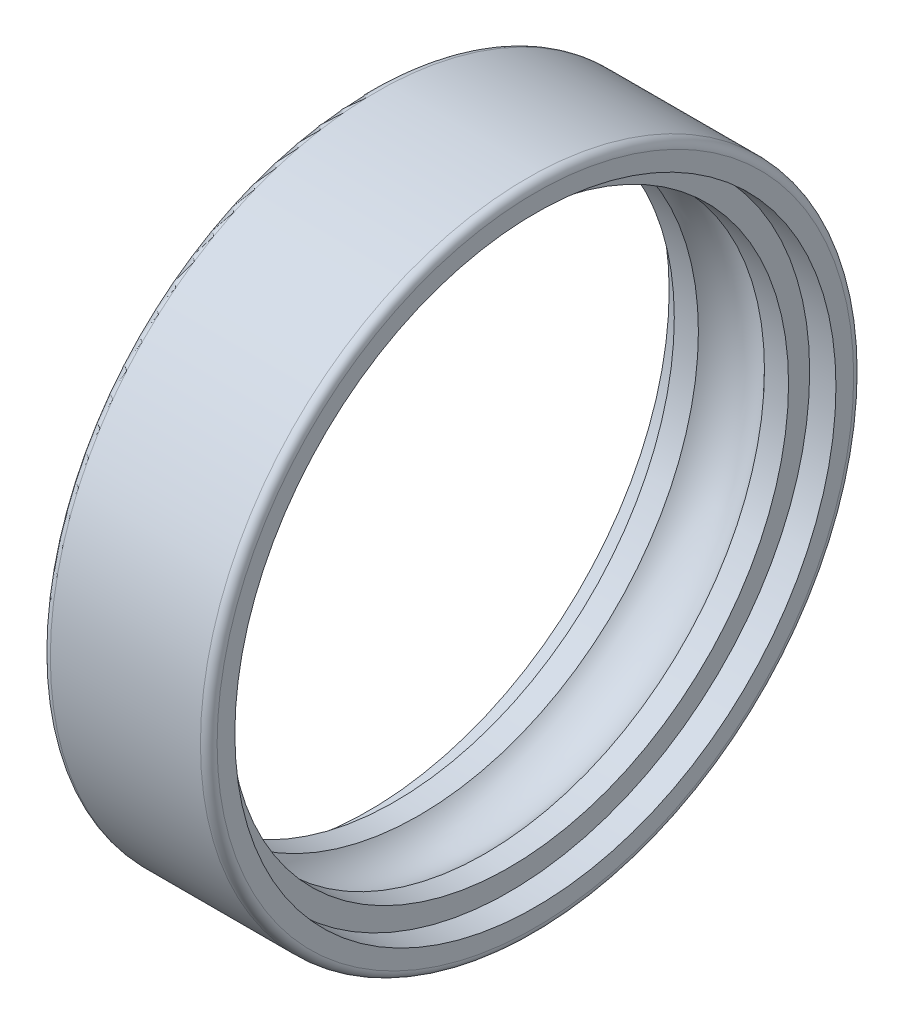
ISO-10303-21;
HEADER;
FILE_DESCRIPTION(('STEP AP214'),'2;1');
FILE_NAME('part.step','',(''),(''),'','','');
FILE_SCHEMA(('AUTOMOTIVE_DESIGN { 1 0 10303 214 1 1 1 1 }'));
ENDSEC;
DATA;
#1=APPLICATION_CONTEXT('core data for automotive mechanical design processes');
#2=APPLICATION_PROTOCOL_DEFINITION('international standard','automotive_design',2000,#1);
#3=PRODUCT_CONTEXT('',#1,'mechanical');
#4=PRODUCT('Part','Part','',(#3));
#5=PRODUCT_RELATED_PRODUCT_CATEGORY('part','',(#4));
#6=PRODUCT_DEFINITION_FORMATION('','',#4);
#7=PRODUCT_DEFINITION_CONTEXT('part definition',#1,'design');
#8=PRODUCT_DEFINITION('design','',#6,#7);
#9=PRODUCT_DEFINITION_SHAPE('','',#8);
#10=(LENGTH_UNIT() NAMED_UNIT(*) SI_UNIT(.MILLI.,.METRE.));
#11=(NAMED_UNIT(*) PLANE_ANGLE_UNIT() SI_UNIT($,.RADIAN.));
#12=(NAMED_UNIT(*) SI_UNIT($,.STERADIAN.) SOLID_ANGLE_UNIT());
#13=UNCERTAINTY_MEASURE_WITH_UNIT(LENGTH_MEASURE(1.E-05),#10,'distance_accuracy_value','');
#14=(GEOMETRIC_REPRESENTATION_CONTEXT(3) GLOBAL_UNCERTAINTY_ASSIGNED_CONTEXT((#13)) GLOBAL_UNIT_ASSIGNED_CONTEXT((#10,
#11,#12)) REPRESENTATION_CONTEXT('',''));
#15=CARTESIAN_POINT('',(0.,0.,0.));
#16=DIRECTION('',(0.,0.,1.));
#17=DIRECTION('',(1.,0.,0.));
#18=AXIS2_PLACEMENT_3D('',#15,#16,#17);
#19=CARTESIAN_POINT('',(6.,0.,0.));
#20=DIRECTION('',(1.,0.,0.));
#21=DIRECTION('',(0.,1.,0.));
#22=AXIS2_PLACEMENT_3D('',#19,#20,#21);
#23=TOROIDAL_SURFACE('',#22,18.,3.175);
#24=CARTESIAN_POINT('',(8.37688916548495,0.,0.));
#25=DIRECTION('',(-1.,0.,0.));
#26=DIRECTION('',(0.,0.,1.));
#27=AXIS2_PLACEMENT_3D('',#24,#25,#26);
#28=CIRCLE('',#27,20.1049995);
#29=CARTESIAN_POINT('',(8.37688916548495,0.,20.1049995));
#30=VERTEX_POINT('',#29);
#31=EDGE_CURVE('E141',#30,#30,#28,.T.);
#32=ORIENTED_EDGE('',*,*,#31,.F.);
#33=EDGE_LOOP('',(#32));
#34=FACE_BOUND('',#33,.T.);
#35=CARTESIAN_POINT('',(3.62311083451505,0.,0.));
#36=DIRECTION('',(-1.,0.,0.));
#37=DIRECTION('',(0.,0.,1.));
#38=AXIS2_PLACEMENT_3D('',#35,#36,#37);
#39=CIRCLE('',#38,20.1049995);
#40=CARTESIAN_POINT('',(3.62311083451505,0.,20.1049995));
#41=VERTEX_POINT('',#40);
#42=EDGE_CURVE('E130',#41,#41,#39,.F.);
#43=ORIENTED_EDGE('',*,*,#42,.F.);
#44=EDGE_LOOP('',(#43));
#45=FACE_BOUND('',#44,.T.);
#46=ADVANCED_FACE('F14',(#34,#45),#23,.F.);
#47=CARTESIAN_POINT('',(1.89,0.,0.));
#48=DIRECTION('',(1.,0.,0.));
#49=DIRECTION('',(0.,0.,-1.));
#50=AXIS2_PLACEMENT_3D('',#47,#48,#49);
#51=CYLINDRICAL_SURFACE('',#50,20.1049995);
#52=CARTESIAN_POINT('',(1.89,0.,0.));
#53=DIRECTION('',(1.,0.,0.));
#54=DIRECTION('',(0.,0.,-1.));
#55=AXIS2_PLACEMENT_3D('',#52,#53,#54);
#56=CIRCLE('',#55,20.1049995);
#57=CARTESIAN_POINT('',(1.89,0.,-20.1049995));
#58=VERTEX_POINT('',#57);
#59=EDGE_CURVE('E18',#58,#58,#56,.T.);
#60=ORIENTED_EDGE('',*,*,#59,.F.);
#61=EDGE_LOOP('',(#60));
#62=FACE_BOUND('',#61,.T.);
#63=ORIENTED_EDGE('',*,*,#42,.T.);
#64=EDGE_LOOP('',(#63));
#65=FACE_BOUND('',#64,.T.);
#66=ADVANCED_FACE('F97',(#62,#65),#51,.F.);
#67=CARTESIAN_POINT('',(8.37688916548495,0.,0.));
#68=DIRECTION('',(1.,0.,0.));
#69=DIRECTION('',(0.,0.,-1.));
#70=AXIS2_PLACEMENT_3D('',#67,#68,#69);
#71=CYLINDRICAL_SURFACE('',#70,20.1049995);
#72=ORIENTED_EDGE('',*,*,#31,.T.);
#73=EDGE_LOOP('',(#72));
#74=FACE_BOUND('',#73,.T.);
#75=CARTESIAN_POINT('',(10.11,0.,0.));
#76=DIRECTION('',(1.,0.,0.));
#77=DIRECTION('',(0.,0.,-1.));
#78=AXIS2_PLACEMENT_3D('',#75,#76,#77);
#79=CIRCLE('',#78,20.1049995);
#80=CARTESIAN_POINT('',(10.11,0.,-20.1049995));
#81=VERTEX_POINT('',#80);
#82=EDGE_CURVE('E136',#81,#81,#79,.F.);
#83=ORIENTED_EDGE('',*,*,#82,.F.);
#84=EDGE_LOOP('',(#83));
#85=FACE_BOUND('',#84,.T.);
#86=ADVANCED_FACE('F94',(#74,#85),#71,.F.);
#87=CARTESIAN_POINT('',(1.89,0.,20.86499975));
#88=DIRECTION('',(-1.,0.,0.));
#89=DIRECTION('',(0.,0.,1.));
#90=AXIS2_PLACEMENT_3D('',#87,#88,#89);
#91=PLANE('',#90);
#92=ORIENTED_EDGE('',*,*,#59,.T.);
#93=EDGE_LOOP('',(#92));
#94=FACE_BOUND('',#93,.T.);
#95=CARTESIAN_POINT('',(1.89,0.,0.));
#96=DIRECTION('',(1.,0.,0.));
#97=DIRECTION('',(0.,0.,-1.));
#98=AXIS2_PLACEMENT_3D('',#95,#96,#97);
#99=CIRCLE('',#98,21.625);
#100=CARTESIAN_POINT('',(1.89,0.,-21.625));
#101=VERTEX_POINT('',#100);
#102=EDGE_CURVE('E134',#101,#101,#99,.T.);
#103=ORIENTED_EDGE('',*,*,#102,.F.);
#104=EDGE_LOOP('',(#103));
#105=FACE_BOUND('',#104,.T.);
#106=ADVANCED_FACE('F90',(#94,#105),#91,.T.);
#107=CARTESIAN_POINT('',(10.11,0.,20.86499975));
#108=DIRECTION('',(1.,0.,0.));
#109=DIRECTION('',(0.,0.,-1.));
#110=AXIS2_PLACEMENT_3D('',#107,#108,#109);
#111=PLANE('',#110);
#112=CARTESIAN_POINT('',(10.11,0.,0.));
#113=DIRECTION('',(1.,0.,0.));
#114=DIRECTION('',(0.,0.,-1.));
#115=AXIS2_PLACEMENT_3D('',#112,#113,#114);
#116=CIRCLE('',#115,21.625);
#117=CARTESIAN_POINT('',(10.11,0.,-21.625));
#118=VERTEX_POINT('',#117);
#119=EDGE_CURVE('E127',#118,#118,#116,.F.);
#120=ORIENTED_EDGE('',*,*,#119,.F.);
#121=EDGE_LOOP('',(#120));
#122=FACE_BOUND('',#121,.T.);
#123=ORIENTED_EDGE('',*,*,#82,.T.);
#124=EDGE_LOOP('',(#123));
#125=FACE_BOUND('',#124,.T.);
#126=ADVANCED_FACE('F86',(#122,#125),#111,.T.);
#127=CARTESIAN_POINT('',(0.,0.,0.));
#128=DIRECTION('',(1.,0.,0.));
#129=DIRECTION('',(0.,0.,-1.));
#130=AXIS2_PLACEMENT_3D('',#127,#128,#129);
#131=CYLINDRICAL_SURFACE('',#130,21.625);
#132=CARTESIAN_POINT('',(0.,0.,0.));
#133=DIRECTION('',(1.,0.,0.));
#134=DIRECTION('',(0.,0.,-1.));
#135=AXIS2_PLACEMENT_3D('',#132,#133,#134);
#136=CIRCLE('',#135,21.625);
#137=CARTESIAN_POINT('',(0.,0.,-21.625));
#138=VERTEX_POINT('',#137);
#139=EDGE_CURVE('E122',#138,#138,#136,.T.);
#140=ORIENTED_EDGE('',*,*,#139,.F.);
#141=EDGE_LOOP('',(#140));
#142=FACE_BOUND('',#141,.T.);
#143=ORIENTED_EDGE('',*,*,#102,.T.);
#144=EDGE_LOOP('',(#143));
#145=FACE_BOUND('',#144,.T.);
#146=ADVANCED_FACE('F82',(#142,#145),#131,.F.);
#147=CARTESIAN_POINT('',(10.11,0.,0.));
#148=DIRECTION('',(1.,0.,0.));
#149=DIRECTION('',(0.,0.,-1.));
#150=AXIS2_PLACEMENT_3D('',#147,#148,#149);
#151=CYLINDRICAL_SURFACE('',#150,21.625);
#152=ORIENTED_EDGE('',*,*,#119,.T.);
#153=EDGE_LOOP('',(#152));
#154=FACE_BOUND('',#153,.T.);
#155=CARTESIAN_POINT('',(12.,0.,0.));
#156=DIRECTION('',(1.,0.,0.));
#157=DIRECTION('',(0.,0.,-1.));
#158=AXIS2_PLACEMENT_3D('',#155,#156,#157);
#159=CIRCLE('',#158,21.625);
#160=CARTESIAN_POINT('',(12.,0.,-21.625));
#161=VERTEX_POINT('',#160);
#162=EDGE_CURVE('E120',#161,#161,#159,.F.);
#163=ORIENTED_EDGE('',*,*,#162,.F.);
#164=EDGE_LOOP('',(#163));
#165=FACE_BOUND('',#164,.T.);
#166=ADVANCED_FACE('F77',(#154,#165),#151,.F.);
#167=CARTESIAN_POINT('',(0.,0.,22.2625));
#168=DIRECTION('',(-1.,0.,0.));
#169=DIRECTION('',(0.,0.,1.));
#170=AXIS2_PLACEMENT_3D('',#167,#168,#169);
#171=PLANE('',#170);
#172=ORIENTED_EDGE('',*,*,#139,.T.);
#173=EDGE_LOOP('',(#172));
#174=FACE_BOUND('',#173,.T.);
#175=CARTESIAN_POINT('',(0.,0.,0.));
#176=DIRECTION('',(1.,0.,0.));
#177=DIRECTION('',(0.,0.,1.));
#178=AXIS2_PLACEMENT_3D('',#175,#176,#177);
#179=CIRCLE('',#178,22.9);
#180=CARTESIAN_POINT('',(0.,0.,22.9));
#181=VERTEX_POINT('',#180);
#182=EDGE_CURVE('E61',#181,#181,#179,.T.);
#183=ORIENTED_EDGE('',*,*,#182,.F.);
#184=EDGE_LOOP('',(#183));
#185=FACE_BOUND('',#184,.T.);
#186=ADVANCED_FACE('F67',(#174,#185),#171,.T.);
#187=CARTESIAN_POINT('',(12.,0.,22.2625));
#188=DIRECTION('',(1.,0.,0.));
#189=DIRECTION('',(0.,0.,-1.));
#190=AXIS2_PLACEMENT_3D('',#187,#188,#189);
#191=PLANE('',#190);
#192=CARTESIAN_POINT('',(12.,0.,0.));
#193=DIRECTION('',(-1.,0.,0.));
#194=DIRECTION('',(0.,0.,1.));
#195=AXIS2_PLACEMENT_3D('',#192,#193,#194);
#196=CIRCLE('',#195,22.9);
#197=CARTESIAN_POINT('',(12.,0.,22.9));
#198=VERTEX_POINT('',#197);
#199=EDGE_CURVE('E27',#198,#198,#196,.T.);
#200=ORIENTED_EDGE('',*,*,#199,.F.);
#201=EDGE_LOOP('',(#200));
#202=FACE_BOUND('',#201,.T.);
#203=ORIENTED_EDGE('',*,*,#162,.T.);
#204=EDGE_LOOP('',(#203));
#205=FACE_BOUND('',#204,.T.);
#206=ADVANCED_FACE('F76',(#202,#205),#191,.T.);
#207=CARTESIAN_POINT('',(0.599999999999998,0.,0.));
#208=DIRECTION('',(1.,0.,0.));
#209=DIRECTION('',(0.,1.,0.));
#210=AXIS2_PLACEMENT_3D('',#207,#208,#209);
#211=TOROIDAL_SURFACE('',#210,22.9,0.599999999999998);
#212=ORIENTED_EDGE('',*,*,#182,.T.);
#213=EDGE_LOOP('',(#212));
#214=FACE_BOUND('',#213,.T.);
#215=CARTESIAN_POINT('',(0.6,0.,0.));
#216=DIRECTION('',(1.,0.,0.));
#217=DIRECTION('',(0.,0.,-1.));
#218=AXIS2_PLACEMENT_3D('',#215,#216,#217);
#219=CIRCLE('',#218,23.5);
#220=CARTESIAN_POINT('',(0.6,0.,-23.5));
#221=VERTEX_POINT('',#220);
#222=EDGE_CURVE('E22',#221,#221,#219,.T.);
#223=ORIENTED_EDGE('',*,*,#222,.F.);
#224=EDGE_LOOP('',(#223));
#225=FACE_BOUND('',#224,.T.);
#226=ADVANCED_FACE('F41',(#214,#225),#211,.T.);
#227=CARTESIAN_POINT('',(11.4,0.,0.));
#228=DIRECTION('',(1.,0.,0.));
#229=DIRECTION('',(0.,1.,0.));
#230=AXIS2_PLACEMENT_3D('',#227,#228,#229);
#231=TOROIDAL_SURFACE('',#230,22.9,0.600000000000001);
#232=CARTESIAN_POINT('',(11.4,0.,0.));
#233=DIRECTION('',(1.,0.,0.));
#234=DIRECTION('',(0.,0.,-1.));
#235=AXIS2_PLACEMENT_3D('',#232,#233,#234);
#236=CIRCLE('',#235,23.5);
#237=CARTESIAN_POINT('',(11.4,0.,-23.5));
#238=VERTEX_POINT('',#237);
#239=EDGE_CURVE('E10',#238,#238,#236,.F.);
#240=ORIENTED_EDGE('',*,*,#239,.F.);
#241=EDGE_LOOP('',(#240));
#242=FACE_BOUND('',#241,.T.);
#243=ORIENTED_EDGE('',*,*,#199,.T.);
#244=EDGE_LOOP('',(#243));
#245=FACE_BOUND('',#244,.T.);
#246=ADVANCED_FACE('F35',(#242,#245),#231,.T.);
#247=CARTESIAN_POINT('',(6.,0.,0.));
#248=DIRECTION('',(1.,0.,0.));
#249=DIRECTION('',(0.,0.,-1.));
#250=AXIS2_PLACEMENT_3D('',#247,#248,#249);
#251=CYLINDRICAL_SURFACE('',#250,23.5);
#252=ORIENTED_EDGE('',*,*,#222,.T.);
#253=EDGE_LOOP('',(#252));
#254=FACE_BOUND('',#253,.T.);
#255=ORIENTED_EDGE('',*,*,#239,.T.);
#256=EDGE_LOOP('',(#255));
#257=FACE_BOUND('',#256,.T.);
#258=ADVANCED_FACE('F40',(#254,#257),#251,.T.);
#259=CLOSED_SHELL('',(#46,#66,#86,#106,#126,#146,#166,#186,#206,#226,#246,#258));
#260=MANIFOLD_SOLID_BREP('B1',#259);
#261=ADVANCED_BREP_SHAPE_REPRESENTATION('',(#18,#260),#14);
#262=SHAPE_DEFINITION_REPRESENTATION(#9,#261);
ENDSEC;
END-ISO-10303-21;
